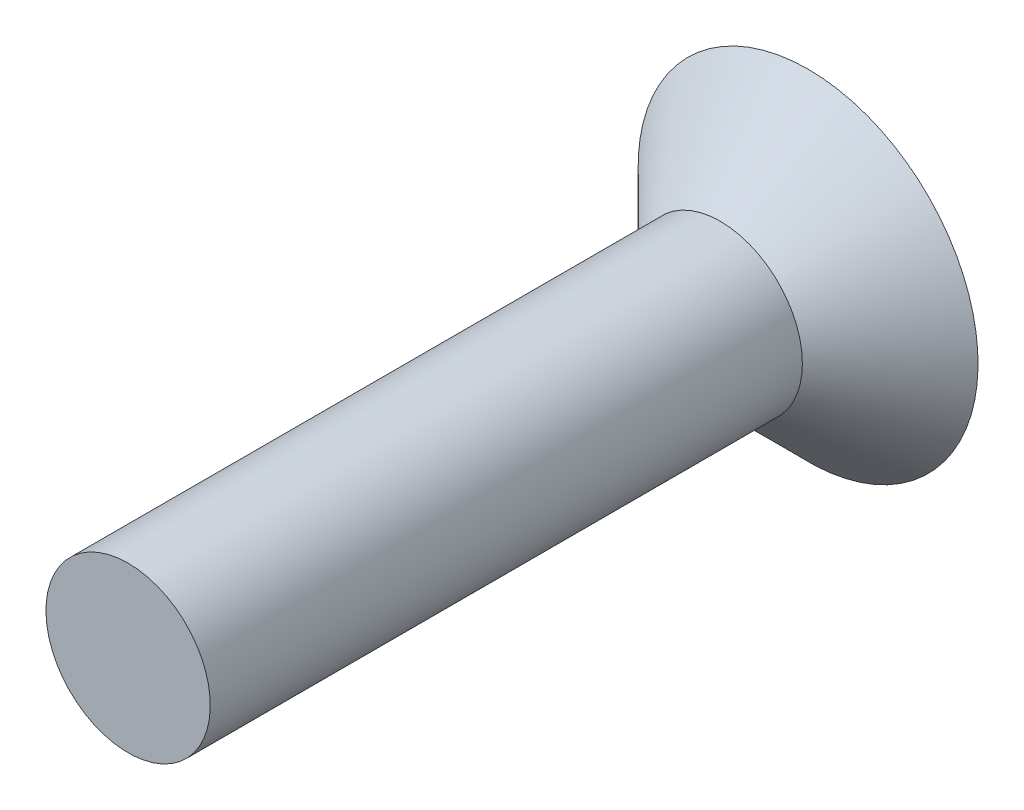
ISO-10303-21;
HEADER;
FILE_DESCRIPTION(('STEP AP214'),'2;1');
FILE_NAME('part.step','',(''),(''),'','','');
FILE_SCHEMA(('AUTOMOTIVE_DESIGN { 1 0 10303 214 1 1 1 1 }'));
ENDSEC;
DATA;
#1=APPLICATION_CONTEXT('core data for automotive mechanical design processes');
#2=APPLICATION_PROTOCOL_DEFINITION('international standard','automotive_design',2000,#1);
#3=PRODUCT_CONTEXT('',#1,'mechanical');
#4=PRODUCT('Part','Part','',(#3));
#5=PRODUCT_RELATED_PRODUCT_CATEGORY('part','',(#4));
#6=PRODUCT_DEFINITION_FORMATION('','',#4);
#7=PRODUCT_DEFINITION_CONTEXT('part definition',#1,'design');
#8=PRODUCT_DEFINITION('design','',#6,#7);
#9=PRODUCT_DEFINITION_SHAPE('','',#8);
#10=(LENGTH_UNIT() NAMED_UNIT(*) SI_UNIT(.MILLI.,.METRE.));
#11=(NAMED_UNIT(*) PLANE_ANGLE_UNIT() SI_UNIT($,.RADIAN.));
#12=(NAMED_UNIT(*) SI_UNIT($,.STERADIAN.) SOLID_ANGLE_UNIT());
#13=UNCERTAINTY_MEASURE_WITH_UNIT(LENGTH_MEASURE(1.E-05),#10,'distance_accuracy_value','');
#14=(GEOMETRIC_REPRESENTATION_CONTEXT(3) GLOBAL_UNCERTAINTY_ASSIGNED_CONTEXT((#13)) GLOBAL_UNIT_ASSIGNED_CONTEXT((#10,
#11,#12)) REPRESENTATION_CONTEXT('',''));
#15=CARTESIAN_POINT('',(0.,0.,0.));
#16=DIRECTION('',(0.,0.,1.));
#17=DIRECTION('',(1.,0.,0.));
#18=AXIS2_PLACEMENT_3D('',#15,#16,#17);
#19=CARTESIAN_POINT('',(0.,0.,0.));
#20=DIRECTION('',(0.,0.,-1.));
#21=DIRECTION('',(0.,1.,0.));
#22=AXIS2_PLACEMENT_3D('',#19,#20,#21);
#23=PLANE('',#22);
#24=CARTESIAN_POINT('',(0.,0.,0.));
#25=DIRECTION('',(0.,0.,-1.));
#26=DIRECTION('',(0.,1.,0.));
#27=AXIS2_PLACEMENT_3D('',#24,#25,#26);
#28=CIRCLE('',#27,3.);
#29=CARTESIAN_POINT('',(0.,3.,0.));
#30=VERTEX_POINT('',#29);
#31=EDGE_CURVE('E10',#30,#30,#28,.T.);
#32=ORIENTED_EDGE('',*,*,#31,.T.);
#33=EDGE_LOOP('',(#32));
#34=FACE_BOUND('',#33,.T.);
#35=ADVANCED_FACE('F32',(#34),#23,.T.);
#36=CARTESIAN_POINT('',(0.,0.,0.));
#37=DIRECTION('',(0.,0.,-1.));
#38=DIRECTION('',(0.,1.,0.));
#39=AXIS2_PLACEMENT_3D('',#36,#37,#38);
#40=CONICAL_SURFACE('',#39,3.,0.785398163397447);
#41=CARTESIAN_POINT('',(0.,0.,1.55));
#42=DIRECTION('',(0.,0.,1.));
#43=DIRECTION('',(0.,-1.,0.));
#44=AXIS2_PLACEMENT_3D('',#41,#42,#43);
#45=CIRCLE('',#44,1.45);
#46=CARTESIAN_POINT('',(0.,-1.45,1.55));
#47=VERTEX_POINT('',#46);
#48=EDGE_CURVE('E38',#47,#47,#45,.T.);
#49=ORIENTED_EDGE('',*,*,#48,.F.);
#50=EDGE_LOOP('',(#49));
#51=FACE_BOUND('',#50,.T.);
#52=ORIENTED_EDGE('',*,*,#31,.F.);
#53=EDGE_LOOP('',(#52));
#54=FACE_BOUND('',#53,.T.);
#55=ADVANCED_FACE('F57',(#51,#54),#40,.T.);
#56=CARTESIAN_POINT('',(0.,0.,12.));
#57=DIRECTION('',(0.,0.,-1.));
#58=DIRECTION('',(-1.,0.,0.));
#59=AXIS2_PLACEMENT_3D('',#56,#57,#58);
#60=CYLINDRICAL_SURFACE('',#59,1.45);
#61=ORIENTED_EDGE('',*,*,#48,.T.);
#62=EDGE_LOOP('',(#61));
#63=FACE_BOUND('',#62,.T.);
#64=CARTESIAN_POINT('',(0.,0.,12.));
#65=DIRECTION('',(0.,0.,-1.));
#66=DIRECTION('',(0.,1.,0.));
#67=AXIS2_PLACEMENT_3D('',#64,#65,#66);
#68=CIRCLE('',#67,1.45);
#69=CARTESIAN_POINT('',(0.,1.45,12.));
#70=VERTEX_POINT('',#69);
#71=EDGE_CURVE('E42',#70,#70,#68,.T.);
#72=ORIENTED_EDGE('',*,*,#71,.T.);
#73=EDGE_LOOP('',(#72));
#74=FACE_BOUND('',#73,.T.);
#75=ADVANCED_FACE('F49',(#63,#74),#60,.T.);
#76=CARTESIAN_POINT('',(0.,0.,12.));
#77=DIRECTION('',(0.,0.,-1.));
#78=DIRECTION('',(0.,1.,0.));
#79=AXIS2_PLACEMENT_3D('',#76,#77,#78);
#80=PLANE('',#79);
#81=ORIENTED_EDGE('',*,*,#71,.F.);
#82=EDGE_LOOP('',(#81));
#83=FACE_BOUND('',#82,.T.);
#84=ADVANCED_FACE('F51',(#83),#80,.F.);
#85=CLOSED_SHELL('',(#35,#55,#75,#84));
#86=MANIFOLD_SOLID_BREP('B2',#85);
#87=ADVANCED_BREP_SHAPE_REPRESENTATION('',(#18,#86),#14);
#88=SHAPE_DEFINITION_REPRESENTATION(#9,#87);
ENDSEC;
END-ISO-10303-21;
